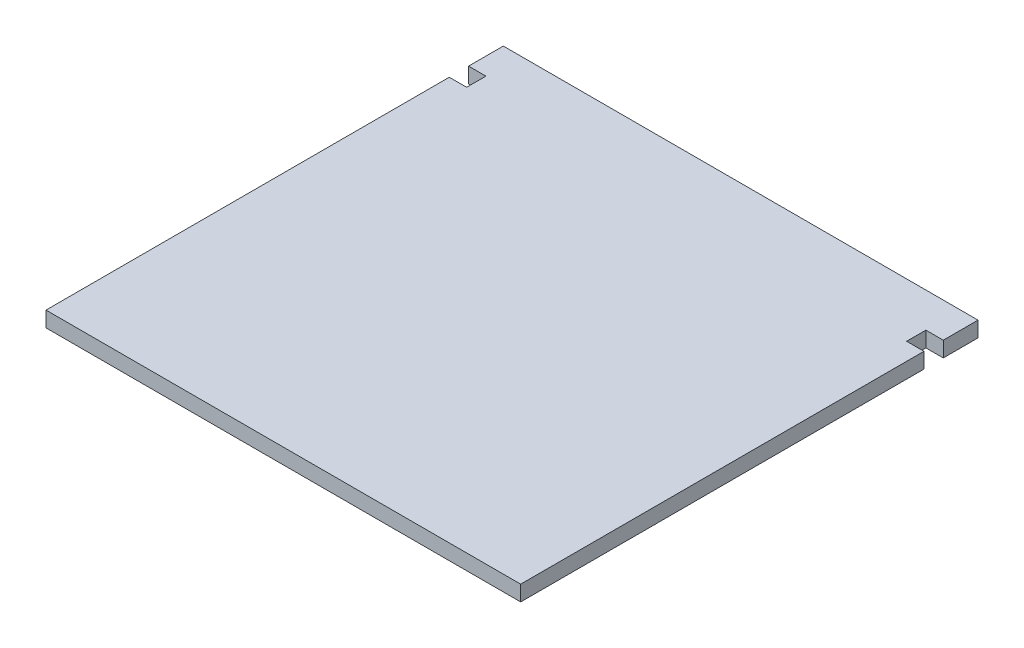
ISO-10303-21;
HEADER;
FILE_DESCRIPTION(('STEP AP214'),'2;1');
FILE_NAME('part.step','',(''),(''),'','','');
FILE_SCHEMA(('AUTOMOTIVE_DESIGN { 1 0 10303 214 1 1 1 1 }'));
ENDSEC;
DATA;
#1=APPLICATION_CONTEXT('core data for automotive mechanical design processes');
#2=APPLICATION_PROTOCOL_DEFINITION('international standard','automotive_design',2000,#1);
#3=PRODUCT_CONTEXT('',#1,'mechanical');
#4=PRODUCT('Part','Part','',(#3));
#5=PRODUCT_RELATED_PRODUCT_CATEGORY('part','',(#4));
#6=PRODUCT_DEFINITION_FORMATION('','',#4);
#7=PRODUCT_DEFINITION_CONTEXT('part definition',#1,'design');
#8=PRODUCT_DEFINITION('design','',#6,#7);
#9=PRODUCT_DEFINITION_SHAPE('','',#8);
#10=(LENGTH_UNIT() NAMED_UNIT(*) SI_UNIT(.MILLI.,.METRE.));
#11=(NAMED_UNIT(*) PLANE_ANGLE_UNIT() SI_UNIT($,.RADIAN.));
#12=(NAMED_UNIT(*) SI_UNIT($,.STERADIAN.) SOLID_ANGLE_UNIT());
#13=UNCERTAINTY_MEASURE_WITH_UNIT(LENGTH_MEASURE(1.E-05),#10,'distance_accuracy_value','');
#14=(GEOMETRIC_REPRESENTATION_CONTEXT(3) GLOBAL_UNCERTAINTY_ASSIGNED_CONTEXT((#13)) GLOBAL_UNIT_ASSIGNED_CONTEXT((#10,
#11,#12)) REPRESENTATION_CONTEXT('',''));
#15=CARTESIAN_POINT('',(0.,0.,0.));
#16=DIRECTION('',(0.,0.,1.));
#17=DIRECTION('',(1.,0.,0.));
#18=AXIS2_PLACEMENT_3D('',#15,#16,#17);
#19=CARTESIAN_POINT('',(-57.,4.,-104.5));
#20=DIRECTION('',(1.,0.,0.));
#21=DIRECTION('',(0.,0.,-1.));
#22=AXIS2_PLACEMENT_3D('',#19,#20,#21);
#23=PLANE('',#22);
#24=DIRECTION('',(0.,0.,1.));
#25=VECTOR('',#24,1.);
#26=CARTESIAN_POINT('',(-57.,0.,-104.5));
#27=LINE('',#26,#25);
#28=CARTESIAN_POINT('',(-57.,0.,-109.5));
#29=VERTEX_POINT('',#28);
#30=CARTESIAN_POINT('',(-57.,0.,-104.5));
#31=VERTEX_POINT('',#30);
#32=EDGE_CURVE('E164',#29,#31,#27,.T.);
#33=ORIENTED_EDGE('',*,*,#32,.T.);
#34=DIRECTION('',(0.,-1.,0.));
#35=VECTOR('',#34,1.);
#36=CARTESIAN_POINT('',(-57.,4.,-104.5));
#37=LINE('',#36,#35);
#38=CARTESIAN_POINT('',(-57.,4.,-104.5));
#39=VERTEX_POINT('',#38);
#40=EDGE_CURVE('E11',#39,#31,#37,.T.);
#41=ORIENTED_EDGE('',*,*,#40,.F.);
#42=DIRECTION('',(0.,0.,1.));
#43=VECTOR('',#42,1.);
#44=CARTESIAN_POINT('',(-57.,4.,-104.5));
#45=LINE('',#44,#43);
#46=CARTESIAN_POINT('',(-57.,4.,-109.5));
#47=VERTEX_POINT('',#46);
#48=EDGE_CURVE('E198',#47,#39,#45,.T.);
#49=ORIENTED_EDGE('',*,*,#48,.F.);
#50=DIRECTION('',(0.,-1.,0.));
#51=VECTOR('',#50,1.);
#52=CARTESIAN_POINT('',(-57.,4.,-109.5));
#53=LINE('',#52,#51);
#54=EDGE_CURVE('E160',#47,#29,#53,.T.);
#55=ORIENTED_EDGE('',*,*,#54,.T.);
#56=EDGE_LOOP('',(#33,#41,#49,#55));
#57=FACE_BOUND('',#56,.T.);
#58=ADVANCED_FACE('F39',(#57),#23,.F.);
#59=CARTESIAN_POINT('',(-61.5,4.,-104.5));
#60=DIRECTION('',(0.,0.,1.));
#61=DIRECTION('',(1.,0.,0.));
#62=AXIS2_PLACEMENT_3D('',#59,#60,#61);
#63=PLANE('',#62);
#64=DIRECTION('',(-1.,0.,0.));
#65=VECTOR('',#64,1.);
#66=CARTESIAN_POINT('',(-61.5,0.,-104.5));
#67=LINE('',#66,#65);
#68=CARTESIAN_POINT('',(-61.5,0.,-104.5));
#69=VERTEX_POINT('',#68);
#70=EDGE_CURVE('E168',#31,#69,#67,.T.);
#71=ORIENTED_EDGE('',*,*,#70,.T.);
#72=DIRECTION('',(0.,-1.,0.));
#73=VECTOR('',#72,1.);
#74=CARTESIAN_POINT('',(-61.5,4.,-104.5));
#75=LINE('',#74,#73);
#76=CARTESIAN_POINT('',(-61.5,4.,-104.5));
#77=VERTEX_POINT('',#76);
#78=EDGE_CURVE('E48',#77,#69,#75,.T.);
#79=ORIENTED_EDGE('',*,*,#78,.F.);
#80=DIRECTION('',(-1.,0.,0.));
#81=VECTOR('',#80,1.);
#82=CARTESIAN_POINT('',(-61.5,4.,-104.5));
#83=LINE('',#82,#81);
#84=EDGE_CURVE('E111',#39,#77,#83,.T.);
#85=ORIENTED_EDGE('',*,*,#84,.F.);
#86=ORIENTED_EDGE('',*,*,#40,.T.);
#87=EDGE_LOOP('',(#71,#79,#85,#86));
#88=FACE_BOUND('',#87,.T.);
#89=ADVANCED_FACE('F292',(#88),#63,.F.);
#90=CARTESIAN_POINT('',(-61.5,4.,0.));
#91=DIRECTION('',(1.,0.,0.));
#92=DIRECTION('',(0.,0.,-1.));
#93=AXIS2_PLACEMENT_3D('',#90,#91,#92);
#94=PLANE('',#93);
#95=DIRECTION('',(0.,0.,1.));
#96=VECTOR('',#95,1.);
#97=CARTESIAN_POINT('',(-61.5,0.,0.));
#98=LINE('',#97,#96);
#99=CARTESIAN_POINT('',(-61.5,0.,0.));
#100=VERTEX_POINT('',#99);
#101=EDGE_CURVE('E171',#69,#100,#98,.T.);
#102=ORIENTED_EDGE('',*,*,#101,.T.);
#103=DIRECTION('',(0.,-1.,0.));
#104=VECTOR('',#103,1.);
#105=CARTESIAN_POINT('',(-61.5,4.,0.));
#106=LINE('',#105,#104);
#107=CARTESIAN_POINT('',(-61.5,4.,0.));
#108=VERTEX_POINT('',#107);
#109=EDGE_CURVE('E225',#108,#100,#106,.T.);
#110=ORIENTED_EDGE('',*,*,#109,.F.);
#111=DIRECTION('',(0.,0.,1.));
#112=VECTOR('',#111,1.);
#113=CARTESIAN_POINT('',(-61.5,4.,0.));
#114=LINE('',#113,#112);
#115=EDGE_CURVE('E235',#77,#108,#114,.T.);
#116=ORIENTED_EDGE('',*,*,#115,.F.);
#117=ORIENTED_EDGE('',*,*,#78,.T.);
#118=EDGE_LOOP('',(#102,#110,#116,#117));
#119=FACE_BOUND('',#118,.T.);
#120=ADVANCED_FACE('F233',(#119),#94,.F.);
#121=CARTESIAN_POINT('',(61.5,4.,0.));
#122=DIRECTION('',(0.,0.,-1.));
#123=DIRECTION('',(-1.,0.,0.));
#124=AXIS2_PLACEMENT_3D('',#121,#122,#123);
#125=PLANE('',#124);
#126=DIRECTION('',(1.,0.,0.));
#127=VECTOR('',#126,1.);
#128=CARTESIAN_POINT('',(61.5,0.,0.));
#129=LINE('',#128,#127);
#130=CARTESIAN_POINT('',(61.5,0.,0.));
#131=VERTEX_POINT('',#130);
#132=EDGE_CURVE('E174',#100,#131,#129,.T.);
#133=ORIENTED_EDGE('',*,*,#132,.T.);
#134=DIRECTION('',(0.,-1.,0.));
#135=VECTOR('',#134,1.);
#136=CARTESIAN_POINT('',(61.5,4.,0.));
#137=LINE('',#136,#135);
#138=CARTESIAN_POINT('',(61.5,4.,0.));
#139=VERTEX_POINT('',#138);
#140=EDGE_CURVE('E221',#139,#131,#137,.T.);
#141=ORIENTED_EDGE('',*,*,#140,.F.);
#142=DIRECTION('',(1.,0.,0.));
#143=VECTOR('',#142,1.);
#144=CARTESIAN_POINT('',(61.5,4.,0.));
#145=LINE('',#144,#143);
#146=EDGE_CURVE('E254',#108,#139,#145,.T.);
#147=ORIENTED_EDGE('',*,*,#146,.F.);
#148=ORIENTED_EDGE('',*,*,#109,.T.);
#149=EDGE_LOOP('',(#133,#141,#147,#148));
#150=FACE_BOUND('',#149,.T.);
#151=ADVANCED_FACE('F244',(#150),#125,.F.);
#152=CARTESIAN_POINT('',(61.5,4.,0.));
#153=DIRECTION('',(-1.,0.,0.));
#154=DIRECTION('',(0.,0.,1.));
#155=AXIS2_PLACEMENT_3D('',#152,#153,#154);
#156=PLANE('',#155);
#157=DIRECTION('',(0.,0.,-1.));
#158=VECTOR('',#157,1.);
#159=CARTESIAN_POINT('',(61.5,0.,0.));
#160=LINE('',#159,#158);
#161=CARTESIAN_POINT('',(61.5,0.,-104.5));
#162=VERTEX_POINT('',#161);
#163=EDGE_CURVE('E177',#131,#162,#160,.T.);
#164=ORIENTED_EDGE('',*,*,#163,.T.);
#165=DIRECTION('',(0.,-1.,0.));
#166=VECTOR('',#165,1.);
#167=CARTESIAN_POINT('',(61.5,4.,-104.5));
#168=LINE('',#167,#166);
#169=CARTESIAN_POINT('',(61.5,4.,-104.5));
#170=VERTEX_POINT('',#169);
#171=EDGE_CURVE('E217',#170,#162,#168,.T.);
#172=ORIENTED_EDGE('',*,*,#171,.F.);
#173=DIRECTION('',(0.,0.,-1.));
#174=VECTOR('',#173,1.);
#175=CARTESIAN_POINT('',(61.5,4.,0.));
#176=LINE('',#175,#174);
#177=EDGE_CURVE('E250',#139,#170,#176,.T.);
#178=ORIENTED_EDGE('',*,*,#177,.F.);
#179=ORIENTED_EDGE('',*,*,#140,.T.);
#180=EDGE_LOOP('',(#164,#172,#178,#179));
#181=FACE_BOUND('',#180,.T.);
#182=ADVANCED_FACE('F248',(#181),#156,.F.);
#183=CARTESIAN_POINT('',(61.5,4.,-104.5));
#184=DIRECTION('',(0.,0.,1.));
#185=DIRECTION('',(1.,0.,0.));
#186=AXIS2_PLACEMENT_3D('',#183,#184,#185);
#187=PLANE('',#186);
#188=DIRECTION('',(-1.,0.,0.));
#189=VECTOR('',#188,1.);
#190=CARTESIAN_POINT('',(61.5,0.,-104.5));
#191=LINE('',#190,#189);
#192=CARTESIAN_POINT('',(57.,0.,-104.5));
#193=VERTEX_POINT('',#192);
#194=EDGE_CURVE('E180',#162,#193,#191,.T.);
#195=ORIENTED_EDGE('',*,*,#194,.T.);
#196=DIRECTION('',(0.,-1.,0.));
#197=VECTOR('',#196,1.);
#198=CARTESIAN_POINT('',(57.,4.,-104.5));
#199=LINE('',#198,#197);
#200=CARTESIAN_POINT('',(57.,4.,-104.5));
#201=VERTEX_POINT('',#200);
#202=EDGE_CURVE('E213',#201,#193,#199,.T.);
#203=ORIENTED_EDGE('',*,*,#202,.F.);
#204=DIRECTION('',(-1.,0.,0.));
#205=VECTOR('',#204,1.);
#206=CARTESIAN_POINT('',(61.5,4.,-104.5));
#207=LINE('',#206,#205);
#208=EDGE_CURVE('E253',#170,#201,#207,.T.);
#209=ORIENTED_EDGE('',*,*,#208,.F.);
#210=ORIENTED_EDGE('',*,*,#171,.T.);
#211=EDGE_LOOP('',(#195,#203,#209,#210));
#212=FACE_BOUND('',#211,.T.);
#213=ADVANCED_FACE('F305',(#212),#187,.F.);
#214=CARTESIAN_POINT('',(57.,4.,-104.5));
#215=DIRECTION('',(-1.,0.,0.));
#216=DIRECTION('',(0.,0.,1.));
#217=AXIS2_PLACEMENT_3D('',#214,#215,#216);
#218=PLANE('',#217);
#219=DIRECTION('',(0.,0.,-1.));
#220=VECTOR('',#219,1.);
#221=CARTESIAN_POINT('',(57.,0.,-104.5));
#222=LINE('',#221,#220);
#223=CARTESIAN_POINT('',(57.,0.,-109.5));
#224=VERTEX_POINT('',#223);
#225=EDGE_CURVE('E183',#193,#224,#222,.T.);
#226=ORIENTED_EDGE('',*,*,#225,.T.);
#227=DIRECTION('',(0.,-1.,0.));
#228=VECTOR('',#227,1.);
#229=CARTESIAN_POINT('',(57.,4.,-109.5));
#230=LINE('',#229,#228);
#231=CARTESIAN_POINT('',(57.,4.,-109.5));
#232=VERTEX_POINT('',#231);
#233=EDGE_CURVE('E209',#232,#224,#230,.T.);
#234=ORIENTED_EDGE('',*,*,#233,.F.);
#235=DIRECTION('',(0.,0.,-1.));
#236=VECTOR('',#235,1.);
#237=CARTESIAN_POINT('',(57.,4.,-104.5));
#238=LINE('',#237,#236);
#239=EDGE_CURVE('E258',#201,#232,#238,.T.);
#240=ORIENTED_EDGE('',*,*,#239,.F.);
#241=ORIENTED_EDGE('',*,*,#202,.T.);
#242=EDGE_LOOP('',(#226,#234,#240,#241));
#243=FACE_BOUND('',#242,.T.);
#244=ADVANCED_FACE('F308',(#243),#218,.F.);
#245=CARTESIAN_POINT('',(57.,4.,-109.5));
#246=DIRECTION('',(0.,0.,-1.));
#247=DIRECTION('',(-1.,0.,0.));
#248=AXIS2_PLACEMENT_3D('',#245,#246,#247);
#249=PLANE('',#248);
#250=DIRECTION('',(1.,0.,0.));
#251=VECTOR('',#250,1.);
#252=CARTESIAN_POINT('',(57.,0.,-109.5));
#253=LINE('',#252,#251);
#254=CARTESIAN_POINT('',(61.5,0.,-109.5));
#255=VERTEX_POINT('',#254);
#256=EDGE_CURVE('E186',#224,#255,#253,.T.);
#257=ORIENTED_EDGE('',*,*,#256,.T.);
#258=DIRECTION('',(0.,-1.,0.));
#259=VECTOR('',#258,1.);
#260=CARTESIAN_POINT('',(61.5,4.,-109.5));
#261=LINE('',#260,#259);
#262=CARTESIAN_POINT('',(61.5,4.,-109.5));
#263=VERTEX_POINT('',#262);
#264=EDGE_CURVE('E205',#263,#255,#261,.T.);
#265=ORIENTED_EDGE('',*,*,#264,.F.);
#266=DIRECTION('',(1.,0.,0.));
#267=VECTOR('',#266,1.);
#268=CARTESIAN_POINT('',(57.,4.,-109.5));
#269=LINE('',#268,#267);
#270=EDGE_CURVE('E265',#232,#263,#269,.T.);
#271=ORIENTED_EDGE('',*,*,#270,.F.);
#272=ORIENTED_EDGE('',*,*,#233,.T.);
#273=EDGE_LOOP('',(#257,#265,#271,#272));
#274=FACE_BOUND('',#273,.T.);
#275=ADVANCED_FACE('F273',(#274),#249,.F.);
#276=CARTESIAN_POINT('',(61.5,4.,-109.5));
#277=DIRECTION('',(-1.,0.,0.));
#278=DIRECTION('',(0.,0.,1.));
#279=AXIS2_PLACEMENT_3D('',#276,#277,#278);
#280=PLANE('',#279);
#281=DIRECTION('',(0.,0.,-1.));
#282=VECTOR('',#281,1.);
#283=CARTESIAN_POINT('',(61.5,0.,-109.5));
#284=LINE('',#283,#282);
#285=CARTESIAN_POINT('',(61.5,0.,-118.5));
#286=VERTEX_POINT('',#285);
#287=EDGE_CURVE('E189',#255,#286,#284,.T.);
#288=ORIENTED_EDGE('',*,*,#287,.T.);
#289=DIRECTION('',(0.,-1.,0.));
#290=VECTOR('',#289,1.);
#291=CARTESIAN_POINT('',(61.5,4.,-118.5));
#292=LINE('',#291,#290);
#293=CARTESIAN_POINT('',(61.5,4.,-118.5));
#294=VERTEX_POINT('',#293);
#295=EDGE_CURVE('E153',#294,#286,#292,.T.);
#296=ORIENTED_EDGE('',*,*,#295,.F.);
#297=DIRECTION('',(0.,0.,-1.));
#298=VECTOR('',#297,1.);
#299=CARTESIAN_POINT('',(61.5,4.,-109.5));
#300=LINE('',#299,#298);
#301=EDGE_CURVE('E142',#263,#294,#300,.T.);
#302=ORIENTED_EDGE('',*,*,#301,.F.);
#303=ORIENTED_EDGE('',*,*,#264,.T.);
#304=EDGE_LOOP('',(#288,#296,#302,#303));
#305=FACE_BOUND('',#304,.T.);
#306=ADVANCED_FACE('F277',(#305),#280,.F.);
#307=CARTESIAN_POINT('',(-61.5,4.,-118.5));
#308=DIRECTION('',(0.,0.,1.));
#309=DIRECTION('',(1.,0.,0.));
#310=AXIS2_PLACEMENT_3D('',#307,#308,#309);
#311=PLANE('',#310);
#312=DIRECTION('',(-1.,0.,0.));
#313=VECTOR('',#312,1.);
#314=CARTESIAN_POINT('',(-61.5,0.,-118.5));
#315=LINE('',#314,#313);
#316=CARTESIAN_POINT('',(-61.5,0.,-118.5));
#317=VERTEX_POINT('',#316);
#318=EDGE_CURVE('E151',#286,#317,#315,.T.);
#319=ORIENTED_EDGE('',*,*,#318,.T.);
#320=DIRECTION('',(0.,-1.,0.));
#321=VECTOR('',#320,1.);
#322=CARTESIAN_POINT('',(-61.5,4.,-118.5));
#323=LINE('',#322,#321);
#324=CARTESIAN_POINT('',(-61.5,4.,-118.5));
#325=VERTEX_POINT('',#324);
#326=EDGE_CURVE('E148',#325,#317,#323,.T.);
#327=ORIENTED_EDGE('',*,*,#326,.F.);
#328=DIRECTION('',(-1.,0.,0.));
#329=VECTOR('',#328,1.);
#330=CARTESIAN_POINT('',(-61.5,4.,-118.5));
#331=LINE('',#330,#329);
#332=EDGE_CURVE('E136',#294,#325,#331,.T.);
#333=ORIENTED_EDGE('',*,*,#332,.F.);
#334=ORIENTED_EDGE('',*,*,#295,.T.);
#335=EDGE_LOOP('',(#319,#327,#333,#334));
#336=FACE_BOUND('',#335,.T.);
#337=ADVANCED_FACE('F149',(#336),#311,.F.);
#338=CARTESIAN_POINT('',(-61.5,4.,-109.5));
#339=DIRECTION('',(1.,0.,0.));
#340=DIRECTION('',(0.,0.,-1.));
#341=AXIS2_PLACEMENT_3D('',#338,#339,#340);
#342=PLANE('',#341);
#343=DIRECTION('',(0.,0.,1.));
#344=VECTOR('',#343,1.);
#345=CARTESIAN_POINT('',(-61.5,0.,-109.5));
#346=LINE('',#345,#344);
#347=CARTESIAN_POINT('',(-61.5,0.,-109.5));
#348=VERTEX_POINT('',#347);
#349=EDGE_CURVE('E97',#317,#348,#346,.T.);
#350=ORIENTED_EDGE('',*,*,#349,.T.);
#351=DIRECTION('',(0.,-1.,0.));
#352=VECTOR('',#351,1.);
#353=CARTESIAN_POINT('',(-61.5,4.,-109.5));
#354=LINE('',#353,#352);
#355=CARTESIAN_POINT('',(-61.5,4.,-109.5));
#356=VERTEX_POINT('',#355);
#357=EDGE_CURVE('E154',#356,#348,#354,.T.);
#358=ORIENTED_EDGE('',*,*,#357,.F.);
#359=DIRECTION('',(0.,0.,1.));
#360=VECTOR('',#359,1.);
#361=CARTESIAN_POINT('',(-61.5,4.,-109.5));
#362=LINE('',#361,#360);
#363=EDGE_CURVE('E140',#325,#356,#362,.T.);
#364=ORIENTED_EDGE('',*,*,#363,.F.);
#365=ORIENTED_EDGE('',*,*,#326,.T.);
#366=EDGE_LOOP('',(#350,#358,#364,#365));
#367=FACE_BOUND('',#366,.T.);
#368=ADVANCED_FACE('F156',(#367),#342,.F.);
#369=CARTESIAN_POINT('',(-57.,4.,-109.5));
#370=DIRECTION('',(0.,0.,-1.));
#371=DIRECTION('',(-1.,0.,0.));
#372=AXIS2_PLACEMENT_3D('',#369,#370,#371);
#373=PLANE('',#372);
#374=DIRECTION('',(1.,0.,0.));
#375=VECTOR('',#374,1.);
#376=CARTESIAN_POINT('',(-57.,0.,-109.5));
#377=LINE('',#376,#375);
#378=EDGE_CURVE('E103',#348,#29,#377,.T.);
#379=ORIENTED_EDGE('',*,*,#378,.T.);
#380=ORIENTED_EDGE('',*,*,#54,.F.);
#381=DIRECTION('',(1.,0.,0.));
#382=VECTOR('',#381,1.);
#383=CARTESIAN_POINT('',(-57.,4.,-109.5));
#384=LINE('',#383,#382);
#385=EDGE_CURVE('E56',#356,#47,#384,.T.);
#386=ORIENTED_EDGE('',*,*,#385,.F.);
#387=ORIENTED_EDGE('',*,*,#357,.T.);
#388=EDGE_LOOP('',(#379,#380,#386,#387));
#389=FACE_BOUND('',#388,.T.);
#390=ADVANCED_FACE('F281',(#389),#373,.F.);
#391=CARTESIAN_POINT('',(0.,4.,0.));
#392=DIRECTION('',(0.,1.,0.));
#393=DIRECTION('',(0.,0.,1.));
#394=AXIS2_PLACEMENT_3D('',#391,#392,#393);
#395=PLANE('',#394);
#396=ORIENTED_EDGE('',*,*,#48,.T.);
#397=ORIENTED_EDGE('',*,*,#84,.T.);
#398=ORIENTED_EDGE('',*,*,#115,.T.);
#399=ORIENTED_EDGE('',*,*,#146,.T.);
#400=ORIENTED_EDGE('',*,*,#177,.T.);
#401=ORIENTED_EDGE('',*,*,#208,.T.);
#402=ORIENTED_EDGE('',*,*,#239,.T.);
#403=ORIENTED_EDGE('',*,*,#270,.T.);
#404=ORIENTED_EDGE('',*,*,#301,.T.);
#405=ORIENTED_EDGE('',*,*,#332,.T.);
#406=ORIENTED_EDGE('',*,*,#363,.T.);
#407=ORIENTED_EDGE('',*,*,#385,.T.);
#408=EDGE_LOOP('',(#396,#397,#398,#399,#400,#401,#402,#403,#404,#405,#406,#407));
#409=FACE_BOUND('',#408,.T.);
#410=ADVANCED_FACE('F138',(#409),#395,.T.);
#411=CARTESIAN_POINT('',(0.,0.,0.));
#412=DIRECTION('',(0.,1.,0.));
#413=DIRECTION('',(0.,0.,1.));
#414=AXIS2_PLACEMENT_3D('',#411,#412,#413);
#415=PLANE('',#414);
#416=ORIENTED_EDGE('',*,*,#32,.F.);
#417=ORIENTED_EDGE('',*,*,#378,.F.);
#418=ORIENTED_EDGE('',*,*,#349,.F.);
#419=ORIENTED_EDGE('',*,*,#318,.F.);
#420=ORIENTED_EDGE('',*,*,#287,.F.);
#421=ORIENTED_EDGE('',*,*,#256,.F.);
#422=ORIENTED_EDGE('',*,*,#225,.F.);
#423=ORIENTED_EDGE('',*,*,#194,.F.);
#424=ORIENTED_EDGE('',*,*,#163,.F.);
#425=ORIENTED_EDGE('',*,*,#132,.F.);
#426=ORIENTED_EDGE('',*,*,#101,.F.);
#427=ORIENTED_EDGE('',*,*,#70,.F.);
#428=EDGE_LOOP('',(#416,#417,#418,#419,#420,#421,#422,#423,#424,#425,#426,#427));
#429=FACE_BOUND('',#428,.T.);
#430=ADVANCED_FACE('F239',(#429),#415,.F.);
#431=CLOSED_SHELL('',(#58,#89,#120,#151,#182,#213,#244,#275,#306,#337,#368,#390,#410,#430));
#432=MANIFOLD_SOLID_BREP('B2',#431);
#433=ADVANCED_BREP_SHAPE_REPRESENTATION('',(#18,#432),#14);
#434=SHAPE_DEFINITION_REPRESENTATION(#9,#433);
ENDSEC;
END-ISO-10303-21;
